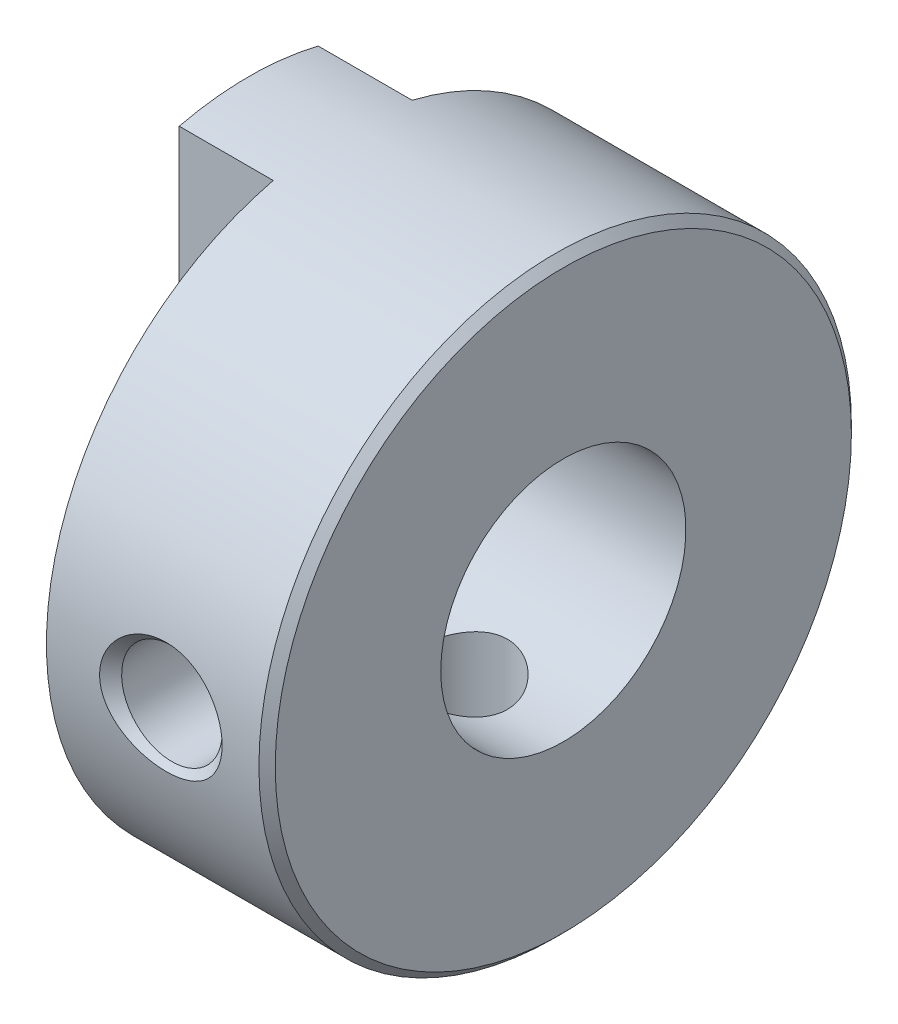
ISO-10303-21;
HEADER;
FILE_DESCRIPTION(('STEP AP214'),'2;1');
FILE_NAME('part.step','',(''),(''),'','','');
FILE_SCHEMA(('AUTOMOTIVE_DESIGN { 1 0 10303 214 1 1 1 1 }'));
ENDSEC;
DATA;
#1=APPLICATION_CONTEXT('core data for automotive mechanical design processes');
#2=APPLICATION_PROTOCOL_DEFINITION('international standard','automotive_design',2000,#1);
#3=PRODUCT_CONTEXT('',#1,'mechanical');
#4=PRODUCT('Part','Part','',(#3));
#5=PRODUCT_RELATED_PRODUCT_CATEGORY('part','',(#4));
#6=PRODUCT_DEFINITION_FORMATION('','',#4);
#7=PRODUCT_DEFINITION_CONTEXT('part definition',#1,'design');
#8=PRODUCT_DEFINITION('design','',#6,#7);
#9=PRODUCT_DEFINITION_SHAPE('','',#8);
#10=(LENGTH_UNIT() NAMED_UNIT(*) SI_UNIT(.MILLI.,.METRE.));
#11=(NAMED_UNIT(*) PLANE_ANGLE_UNIT() SI_UNIT($,.RADIAN.));
#12=(NAMED_UNIT(*) SI_UNIT($,.STERADIAN.) SOLID_ANGLE_UNIT());
#13=UNCERTAINTY_MEASURE_WITH_UNIT(LENGTH_MEASURE(1.E-05),#10,'distance_accuracy_value','');
#14=(GEOMETRIC_REPRESENTATION_CONTEXT(3) GLOBAL_UNCERTAINTY_ASSIGNED_CONTEXT((#13)) GLOBAL_UNIT_ASSIGNED_CONTEXT((#10,
#11,#12)) REPRESENTATION_CONTEXT('',''));
#15=CARTESIAN_POINT('',(0.,0.,0.));
#16=DIRECTION('',(0.,0.,1.));
#17=DIRECTION('',(1.,0.,0.));
#18=AXIS2_PLACEMENT_3D('',#15,#16,#17);
#19=CARTESIAN_POINT('',(5.4,0.,7.25162300000193));
#20=DIRECTION('',(0.,0.,1.));
#21=DIRECTION('',(1.,0.,0.));
#22=AXIS2_PLACEMENT_3D('',#19,#20,#21);
#23=CONICAL_SURFACE('',#22,1.50162299996737,0.785398163397448);
#24=CARTESIAN_POINT('',(5.4,0.,6.9795));
#25=DIRECTION('',(0.,0.,-1.));
#26=DIRECTION('',(0.,1.,0.));
#27=AXIS2_PLACEMENT_3D('',#24,#25,#26);
#28=CIRCLE('',#27,1.2295);
#29=CARTESIAN_POINT('',(5.4,1.2295,6.9795));
#30=VERTEX_POINT('',#29);
#31=EDGE_CURVE('E91',#30,#30,#28,.T.);
#32=ORIENTED_EDGE('',*,*,#31,.T.);
#33=EDGE_LOOP('',(#32));
#34=FACE_BOUND('',#33,.T.);
#35=CARTESIAN_POINT('',(6.89999999996705,0.,7.24999999999612));
#36=CARTESIAN_POINT('',(6.89999427514196,-0.0747291367992958,7.24999809172362));
#37=CARTESIAN_POINT('',(6.89321712195835,-0.14955836855151,7.24882959299291));
#38=CARTESIAN_POINT('',(6.86643720370093,-0.296824894614971,7.24429781560447));
#39=CARTESIAN_POINT('',(6.8464086780923,-0.36925724084981,7.2409302621728));
#40=CARTESIAN_POINT('',(6.79594187660678,-0.504603303096779,7.23271440670023));
#41=CARTESIAN_POINT('',(6.76631411268737,-0.567829063033793,7.22798384900006));
#42=CARTESIAN_POINT('',(6.69763255041028,-0.688772984074368,7.21746357544799));
#43=CARTESIAN_POINT('',(6.65858236062102,-0.746493241876686,7.21167426527847));
#44=CARTESIAN_POINT('',(6.56920706563386,-0.859327471027166,7.19913265249924));
#45=CARTESIAN_POINT('',(6.51827172630525,-0.913952871674558,7.19234100628031));
#46=CARTESIAN_POINT('',(6.40861244759573,-1.01475039384937,7.17881426122209));
#47=CARTESIAN_POINT('',(6.34988399057377,-1.06091757494001,7.17207919760995));
#48=CARTESIAN_POINT('',(6.22042778848734,-1.14798722867463,7.15868337478322));
#49=CARTESIAN_POINT('',(6.14909167557426,-1.18799583369443,7.1520882519355));
#50=CARTESIAN_POINT('',(6.00097820192068,-1.25642977973732,7.14038471197245));
#51=CARTESIAN_POINT('',(5.92420132917289,-1.28485615805388,7.13527616173277));
#52=CARTESIAN_POINT('',(5.77338159558935,-1.32793042323191,7.12737961387102));
#53=CARTESIAN_POINT('',(5.69960612631613,-1.34349354595094,7.12443949984581));
#54=CARTESIAN_POINT('',(5.55056066467196,-1.36427068473264,7.12048987418846));
#55=CARTESIAN_POINT('',(5.47529048882876,-1.36948342227566,7.11948060106181));
#56=CARTESIAN_POINT('',(5.3101149363233,-1.36947966923205,7.11948303738581));
#57=CARTESIAN_POINT('',(5.2202009213121,-1.36204566988025,7.12092442501107));
#58=CARTESIAN_POINT('',(5.04287949933191,-1.33242904087172,7.12652468160678));
#59=CARTESIAN_POINT('',(4.95547352984289,-1.31023812275574,7.13068507772917));
#60=CARTESIAN_POINT('',(4.78585696916784,-1.25153559814627,7.14122143164934));
#61=CARTESIAN_POINT('',(4.70364000461491,-1.21504197258608,7.14759460646487));
#62=CARTESIAN_POINT('',(4.54686849313921,-1.12839229867872,7.16178399013383));
#63=CARTESIAN_POINT('',(4.47231262833893,-1.07823860560043,7.16959995014743));
#64=CARTESIAN_POINT('',(4.33587265709776,-0.96718385014953,7.18540792779984));
#65=CARTESIAN_POINT('',(4.27364501675017,-0.906704095517743,7.1933850280879));
#66=CARTESIAN_POINT('',(4.16131989977757,-0.775233649090914,7.20873583764939));
#67=CARTESIAN_POINT('',(4.1112202053894,-0.704244882846388,7.21610965707757));
#68=CARTESIAN_POINT('',(4.02914184408745,-0.559933950232848,7.22867796612639));
#69=CARTESIAN_POINT('',(3.9960188586439,-0.487273801720987,7.2340011149047));
#70=CARTESIAN_POINT('',(3.94385602612471,-0.337061433975941,7.24254791022065));
#71=CARTESIAN_POINT('',(3.92477687513083,-0.259523532081718,7.24577741311253));
#72=CARTESIAN_POINT('',(3.90883028141451,-0.151016480242844,7.24848976641585));
#73=CARTESIAN_POINT('',(3.90552380614385,-0.120917686555794,7.24905444154122));
#74=CARTESIAN_POINT('',(3.90110741122121,-0.0605514175099595,7.24980996103482));
#75=CARTESIAN_POINT('',(3.89999768005297,-0.0302839279002416,7.25000077332507));
#76=CARTESIAN_POINT('',(3.90000572486061,0.0747291367994648,7.24999809172988));
#77=CARTESIAN_POINT('',(3.90678287804236,0.149558368551713,7.24882959299459));
#78=CARTESIAN_POINT('',(3.93356279629843,0.296824894615125,7.24429781560278));
#79=CARTESIAN_POINT('',(3.95359132190755,0.36925724084988,7.24093026217237));
#80=CARTESIAN_POINT('',(4.00405812339338,0.504603303096753,7.23271440670064));
#81=CARTESIAN_POINT('',(4.03368588731266,0.567829063033749,7.22798384900017));
#82=CARTESIAN_POINT('',(4.10236744958966,0.68877298407433,7.21746357544789));
#83=CARTESIAN_POINT('',(4.14141763937895,0.746493241876667,7.21167426527844));
#84=CARTESIAN_POINT('',(4.23079293436615,0.859327471027168,7.19913265249927));
#85=CARTESIAN_POINT('',(4.28172827369476,0.913952871674564,7.19234100628031));
#86=CARTESIAN_POINT('',(4.39138755240427,1.01475039384937,7.17881426122208));
#87=CARTESIAN_POINT('',(4.45011600942623,1.06091757494001,7.17207919760996));
#88=CARTESIAN_POINT('',(4.57957221151267,1.14798722867464,7.15868337478321));
#89=CARTESIAN_POINT('',(4.65090832442577,1.18799583369447,7.15208825193543));
#90=CARTESIAN_POINT('',(4.79902179807935,1.25642977973731,7.14038471197252));
#91=CARTESIAN_POINT('',(4.87579867082713,1.2848561580538,7.13527616173304));
#92=CARTESIAN_POINT('',(5.02661840441074,1.32793042323201,7.12737961387077));
#93=CARTESIAN_POINT('',(5.10039387368406,1.34349354595125,7.12443949984494));
#94=CARTESIAN_POINT('',(5.24943933532853,1.36427068473242,7.12048987418932));
#95=CARTESIAN_POINT('',(5.32470951117195,1.36948342227471,7.11948060106505));
#96=CARTESIAN_POINT('',(5.48988506367755,1.36947966923084,7.11948303738959));
#97=CARTESIAN_POINT('',(5.57979907868866,1.36204566987984,7.1209244250121));
#98=CARTESIAN_POINT('',(5.75712050066849,1.33242904087193,7.12652468160579));
#99=CARTESIAN_POINT('',(5.84452647015725,1.31023812275577,7.13068507772891));
#100=CARTESIAN_POINT('',(6.01414303083201,1.25153559814624,7.1412214316496));
#101=CARTESIAN_POINT('',(6.09635999538489,1.21504197258615,7.14759460646493));
#102=CARTESIAN_POINT('',(6.25313150686057,1.12839229867888,7.16178399013374));
#103=CARTESIAN_POINT('',(6.32768737166089,1.07823860560057,7.16959995014739));
#104=CARTESIAN_POINT('',(6.46412734290211,0.967183850149643,7.18540792779985));
#105=CARTESIAN_POINT('',(6.52635498324973,0.906704095517841,7.19338502808791));
#106=CARTESIAN_POINT('',(6.63868010022235,0.77523364909102,7.20873583764935));
#107=CARTESIAN_POINT('',(6.68877979461053,0.704244882846526,7.21610965707749));
#108=CARTESIAN_POINT('',(6.77085815591242,0.559933950233054,7.22867796612643));
#109=CARTESIAN_POINT('',(6.80398114135591,0.487273801721228,7.23400111490489));
#110=CARTESIAN_POINT('',(6.85614397387531,0.337061433976191,7.24254791022043));
#111=CARTESIAN_POINT('',(6.87522312486945,0.259523532081938,7.24577741311173));
#112=CARTESIAN_POINT('',(6.89116971858535,0.151016480243001,7.24848976641615));
#113=CARTESIAN_POINT('',(6.89447619385581,0.120917686555926,7.24905444154202));
#114=CARTESIAN_POINT('',(6.89889258877912,0.0605514175100764,7.24980996103401));
#115=CARTESIAN_POINT('',(6.90000231994822,0.0302839279003669,7.25000077332216));
#116=CARTESIAN_POINT('',(6.89999999996705,0.,7.24999999999612));
#117=B_SPLINE_CURVE_WITH_KNOTS('',3,(#35,#36,#37,#38,#39,#40,#41,#42,#43,#44,#45,#46,#47,#48,
#49,#50,#51,#52,#53,#54,#55,#56,#57,#58,#59,#60,#61,#62,#63,#64,#65,#66,#67,#68,#69,#70,#71,#72,
#73,#74,#75,#76,#77,#78,#79,#80,#81,#82,#83,#84,#85,#86,#87,#88,#89,#90,#91,#92,#93,#94,#95,#96,
#97,#98,#99,#100,#101,#102,#103,#104,#105,#106,#107,#108,#109,#110,#111,#112,#113,#114,#115,
#116),.UNSPECIFIED.,.T.,.F.,(4,2,2,2,2,2,2,2,2,2,2,2,2,2,2,2,2,2,2,2,2,2,2,2,2,2,2,2,2,2,2,2,2,
2,2,2,2,2,2,2,4),(0.,0.224055146580427,0.448547138937669,0.657602313094664,0.86657755073939,
1.09063144600252,1.31481579654558,1.55992930631005,1.80502085910826,2.03064066577801,
2.25628834014641,2.52567635840238,2.79521581068323,3.06441748745475,3.33357277782348,
3.59361636116129,3.85361235594049,4.09241268280953,4.33054212094667,4.421332515226,
4.51213069911203,4.73618584569246,4.96067783804948,5.16973301220641,5.3787082498512,
5.60276214511434,5.82694649565739,6.07206000542191,6.31715155822007,6.54277136489013,
6.76841903925903,7.03780705751456,7.30734650979468,7.57654818656603,7.84570347693481,
8.10574706027273,8.36574305505184,8.60454338192078,8.84267282005804,8.93346321433743,
9.02426139822348),.UNSPECIFIED.);
#118=CARTESIAN_POINT('',(6.89999999996705,0.,7.24999999999612));
#119=VERTEX_POINT('',#118);
#120=EDGE_CURVE('E102',#119,#119,#117,.T.);
#121=ORIENTED_EDGE('',*,*,#120,.F.);
#122=EDGE_LOOP('',(#121));
#123=FACE_BOUND('',#122,.T.);
#124=ADVANCED_FACE('F17',(#34,#123),#23,.F.);
#125=CARTESIAN_POINT('',(5.4,-7.25162300000193,0.));
#126=DIRECTION('',(0.,-1.,0.));
#127=DIRECTION('',(0.,0.,-1.));
#128=AXIS2_PLACEMENT_3D('',#125,#126,#127);
#129=CONICAL_SURFACE('',#128,1.50162299996737,0.785398163397448);
#130=CARTESIAN_POINT('',(5.4,-7.1194817115895,-1.3694817115595));
#131=CARTESIAN_POINT('',(5.31011493632329,-7.11948303738581,-1.36947966923205));
#132=CARTESIAN_POINT('',(5.2202009213121,-7.12092442501107,-1.36204566988025));
#133=CARTESIAN_POINT('',(5.04287949933191,-7.12652468160678,-1.33242904087172));
#134=CARTESIAN_POINT('',(4.95547352984289,-7.13068507772917,-1.31023812275574));
#135=CARTESIAN_POINT('',(4.78585696916784,-7.14122143164934,-1.25153559814627));
#136=CARTESIAN_POINT('',(4.70364000461492,-7.14759460646487,-1.21504197258609));
#137=CARTESIAN_POINT('',(4.54686849313922,-7.16178399013383,-1.12839229867872));
#138=CARTESIAN_POINT('',(4.47231262833893,-7.16959995014743,-1.07823860560043));
#139=CARTESIAN_POINT('',(4.33587265709775,-7.18540792779984,-0.967183850149525));
#140=CARTESIAN_POINT('',(4.27364501675016,-7.19338502808791,-0.906704095517728));
#141=CARTESIAN_POINT('',(4.16131989977756,-7.20873583764938,-0.775233649090896));
#142=CARTESIAN_POINT('',(4.11122020538939,-7.21610965707754,-0.704244882846378));
#143=CARTESIAN_POINT('',(4.02914184408747,-7.22867796612641,-0.559933950232861));
#144=CARTESIAN_POINT('',(3.99601885864395,-7.23400111490479,-0.487273801721013));
#145=CARTESIAN_POINT('',(3.94385602612468,-7.24254791022055,-0.337061433975969));
#146=CARTESIAN_POINT('',(3.92477687513069,-7.24577741311216,-0.259523532081734));
#147=CARTESIAN_POINT('',(3.90883028141457,-7.24848976641599,-0.15101648024286));
#148=CARTESIAN_POINT('',(3.905523806144,-7.24905444154159,-0.120917686555825));
#149=CARTESIAN_POINT('',(3.90110741122106,-7.24980996103444,-0.0605514175100361));
#150=CARTESIAN_POINT('',(3.89999768005243,-7.25000077332373,-0.030283927900348));
#151=CARTESIAN_POINT('',(3.90000572485944,-7.24999809172699,0.074729136799434));
#152=CARTESIAN_POINT('',(3.90678287804205,-7.24882959299381,0.149558368551789));
#153=CARTESIAN_POINT('',(3.93356279629881,-7.24429781560355,0.296824894615455));
#154=CARTESIAN_POINT('',(3.95359132190777,-7.24093026217254,0.369257240850359));
#155=CARTESIAN_POINT('',(4.00405812339357,-7.23271440670041,0.504603303097355));
#156=CARTESIAN_POINT('',(4.03368588731293,-7.22798384900008,0.567829063034338));
#157=CARTESIAN_POINT('',(4.10236744959002,-7.21746357544789,0.688772984074874));
#158=CARTESIAN_POINT('',(4.14141763937933,-7.2116742652784,0.746493241877181));
#159=CARTESIAN_POINT('',(4.23079293436656,-7.1991326524992,0.859327471027642));
#160=CARTESIAN_POINT('',(4.28172827369521,-7.19234100628025,0.913952871675024));
#161=CARTESIAN_POINT('',(4.39138755240478,-7.17881426122202,1.0147503938498));
#162=CARTESIAN_POINT('',(4.45011600942677,-7.17207919760989,1.06091757494042));
#163=CARTESIAN_POINT('',(4.57957221151325,-7.15868337478317,1.14798722867498));
#164=CARTESIAN_POINT('',(4.65090832442635,-7.15208825193545,1.18799583369476));
#165=CARTESIAN_POINT('',(4.79902179807998,-7.1403847119724,1.25642977973758));
#166=CARTESIAN_POINT('',(4.8757986708278,-7.13527616173273,1.28485615805411));
#167=CARTESIAN_POINT('',(5.02661840441125,-7.12737961387099,1.32793042323204));
#168=CARTESIAN_POINT('',(5.10039387368436,-7.1244394998458,1.34349354595102));
#169=CARTESIAN_POINT('',(5.24943933532829,-7.12048987418846,1.36427068473265));
#170=CARTESIAN_POINT('',(5.32470951117136,-7.11948060106181,1.36948342227566));
#171=CARTESIAN_POINT('',(5.4898850636767,-7.11948303738581,1.36947966923205));
#172=CARTESIAN_POINT('',(5.5797990786879,-7.12092442501107,1.36204566988025));
#173=CARTESIAN_POINT('',(5.75712050066809,-7.12652468160678,1.33242904087172));
#174=CARTESIAN_POINT('',(5.84452647015711,-7.13068507772917,1.31023812275574));
#175=CARTESIAN_POINT('',(6.01414303083216,-7.14122143164934,1.25153559814626));
#176=CARTESIAN_POINT('',(6.09635999538509,-7.14759460646487,1.21504197258608));
#177=CARTESIAN_POINT('',(6.25313150686079,-7.16178399013383,1.12839229867872));
#178=CARTESIAN_POINT('',(6.32768737166108,-7.16959995014743,1.07823860560043));
#179=CARTESIAN_POINT('',(6.46412734290224,-7.18540792779984,0.96718385014953));
#180=CARTESIAN_POINT('',(6.52635498324983,-7.1933850280879,0.906704095517742));
#181=CARTESIAN_POINT('',(6.63868010022243,-7.20873583764939,0.775233649090912));
#182=CARTESIAN_POINT('',(6.6887797946106,-7.21610965707757,0.704244882846386));
#183=CARTESIAN_POINT('',(6.77085815591255,-7.22867796612639,0.559933950232847));
#184=CARTESIAN_POINT('',(6.8039811413561,-7.2340011149047,0.487273801720986));
#185=CARTESIAN_POINT('',(6.85614397387529,-7.24254791022065,0.33706143397594));
#186=CARTESIAN_POINT('',(6.87522312486917,-7.24577741311253,0.259523532081717));
#187=CARTESIAN_POINT('',(6.89116971858549,-7.24848976641585,0.151016480242856));
#188=CARTESIAN_POINT('',(6.89447619385615,-7.24905444154122,0.120917686555817));
#189=CARTESIAN_POINT('',(6.89889258877879,-7.24980996103482,0.0605514175100075));
#190=CARTESIAN_POINT('',(6.90000231994703,-7.25000077332507,0.0302839279003017));
#191=CARTESIAN_POINT('',(6.8999942751394,-7.24999809172988,-0.074729136799514));
#192=CARTESIAN_POINT('',(6.89321712195763,-7.24882959299458,-0.149558368551885));
#193=CARTESIAN_POINT('',(6.86643720370148,-7.24429781560277,-0.296824894615529));
#194=CARTESIAN_POINT('',(6.8464086780923,-7.24093026217234,-0.369257240850394));
#195=CARTESIAN_POINT('',(6.79594187660636,-7.2327144067006,-0.504603303097346));
#196=CARTESIAN_POINT('',(6.76631411268706,-7.22798384900013,-0.567829063034321));
#197=CARTESIAN_POINT('',(6.69763255041001,-7.21746357544784,-0.688772984074859));
#198=CARTESIAN_POINT('',(6.65858236062068,-7.21167426527839,-0.746493241877176));
#199=CARTESIAN_POINT('',(6.56920706563343,-7.19913265249921,-0.85932747102765));
#200=CARTESIAN_POINT('',(6.51827172630478,-7.19234100628025,-0.913952871675035));
#201=CARTESIAN_POINT('',(6.40861244759521,-7.17881426122201,-1.01475039384981));
#202=CARTESIAN_POINT('',(6.34988399057323,-7.17207919760989,-1.06091757494042));
#203=CARTESIAN_POINT('',(6.22042778848675,-7.15868337478317,-1.14798722867498));
#204=CARTESIAN_POINT('',(6.14909167557365,-7.15208825193545,-1.18799583369476));
#205=CARTESIAN_POINT('',(6.00097820192002,-7.1403847119724,-1.25642977973758));
#206=CARTESIAN_POINT('',(5.9242013291722,-7.13527616173273,-1.28485615805411));
#207=CARTESIAN_POINT('',(5.77338159558875,-7.12737961387099,-1.32793042323205));
#208=CARTESIAN_POINT('',(5.69960612631564,-7.1244394998458,-1.34349354595102));
#209=CARTESIAN_POINT('',(5.55056066467171,-7.12048987418846,-1.36427068473266));
#210=CARTESIAN_POINT('',(5.47529048882864,-7.11948060106181,-1.36948342227566));
#211=CARTESIAN_POINT('',(5.4,-7.1194817115895,-1.3694817115595));
#212=B_SPLINE_CURVE_WITH_KNOTS('',3,(#130,#131,#132,#133,#134,#135,#136,#137,#138,#139,#140,
#141,#142,#143,#144,#145,#146,#147,#148,#149,#150,#151,#152,#153,#154,#155,#156,#157,#158,#159,
#160,#161,#162,#163,#164,#165,#166,#167,#168,#169,#170,#171,#172,#173,#174,#175,#176,#177,#178,
#179,#180,#181,#182,#183,#184,#185,#186,#187,#188,#189,#190,#191,#192,#193,#194,#195,#196,#197,
#198,#199,#200,#201,#202,#203,#204,#205,#206,#207,#208,#209,#210,#211),.UNSPECIFIED.,.T.,.F.,(4,
2,2,2,2,2,2,2,2,2,2,2,2,2,2,2,2,2,2,2,2,2,2,2,2,2,2,2,2,2,2,2,2,2,2,2,2,2,2,2,4),(0.,
0.26938801825597,0.538927470536824,0.80812914730833,1.07728443767707,1.33732802101491,
1.59732401579408,1.83612434266307,2.07425378080026,2.16504417507954,2.2558423589655,
2.47989750554629,2.70438949790377,2.91344467206071,3.12241990970546,3.34647380496865,
3.57065815551171,3.8157716652762,4.06086321807445,4.28648302474383,4.51213069911186,
4.78151871736783,5.05105816964869,5.32025984642021,5.58941513678893,5.84945872012674,
6.10945471490594,6.34825504177498,6.58638447991212,6.67717487419141,6.76797305807741,
6.9920282046582,7.21652019701558,7.42557537117249,7.63455060881727,7.85860450408047,
8.08278885462352,8.327902364388,8.57299391718626,8.79861372385565,9.02426139822367),.UNSPECIFIED.);
#213=CARTESIAN_POINT('',(5.4,-7.1194817115895,-1.3694817115595));
#214=VERTEX_POINT('',#213);
#215=EDGE_CURVE('E173',#214,#214,#212,.T.);
#216=ORIENTED_EDGE('',*,*,#215,.F.);
#217=EDGE_LOOP('',(#216));
#218=FACE_BOUND('',#217,.T.);
#219=CARTESIAN_POINT('',(5.4,-6.9795,0.));
#220=DIRECTION('',(0.,1.,0.));
#221=DIRECTION('',(0.,0.,1.));
#222=AXIS2_PLACEMENT_3D('',#219,#220,#221);
#223=CIRCLE('',#222,1.2295);
#224=CARTESIAN_POINT('',(5.4,-6.9795,1.2295));
#225=VERTEX_POINT('',#224);
#226=EDGE_CURVE('E109',#225,#225,#223,.T.);
#227=ORIENTED_EDGE('',*,*,#226,.T.);
#228=EDGE_LOOP('',(#227));
#229=FACE_BOUND('',#228,.T.);
#230=ADVANCED_FACE('F168',(#218,#229),#129,.F.);
#231=CARTESIAN_POINT('',(0.3,-7.25,-1.7));
#232=DIRECTION('',(0.,0.,1.));
#233=DIRECTION('',(1.,0.,0.));
#234=AXIS2_PLACEMENT_3D('',#231,#232,#233);
#235=PLANE('',#234);
#236=DIRECTION('',(0.,1.,0.));
#237=VECTOR('',#236,1.);
#238=CARTESIAN_POINT('',(2.6,0.,-1.7));
#239=LINE('',#238,#237);
#240=CARTESIAN_POINT('',(2.6,2.47184141886166,-1.7));
#241=VERTEX_POINT('',#240);
#242=CARTESIAN_POINT('',(2.6,7.04787201926936,-1.7));
#243=VERTEX_POINT('',#242);
#244=EDGE_CURVE('E112',#241,#243,#239,.T.);
#245=ORIENTED_EDGE('',*,*,#244,.F.);
#246=DIRECTION('',(-1.,0.,0.));
#247=VECTOR('',#246,1.);
#248=CARTESIAN_POINT('',(4.15,2.47184141886166,-1.7));
#249=LINE('',#248,#247);
#250=CARTESIAN_POINT('',(0.3,2.47184141886166,-1.7));
#251=VERTEX_POINT('',#250);
#252=EDGE_CURVE('E178',#241,#251,#249,.T.);
#253=ORIENTED_EDGE('',*,*,#252,.T.);
#254=DIRECTION('',(0.,1.,0.));
#255=VECTOR('',#254,1.);
#256=CARTESIAN_POINT('',(0.3,0.,-1.7));
#257=LINE('',#256,#255);
#258=CARTESIAN_POINT('',(0.3,7.04787201926936,-1.7));
#259=VERTEX_POINT('',#258);
#260=EDGE_CURVE('E92',#259,#251,#257,.F.);
#261=ORIENTED_EDGE('',*,*,#260,.F.);
#262=DIRECTION('',(-1.,0.,0.));
#263=VECTOR('',#262,1.);
#264=CARTESIAN_POINT('',(4.05,7.04787201926936,-1.7));
#265=LINE('',#264,#263);
#266=EDGE_CURVE('E108',#243,#259,#265,.T.);
#267=ORIENTED_EDGE('',*,*,#266,.F.);
#268=EDGE_LOOP('',(#245,#253,#261,#267));
#269=FACE_BOUND('',#268,.T.);
#270=ADVANCED_FACE('F166',(#269),#235,.F.);
#271=CARTESIAN_POINT('',(0.3,0.,-5.125));
#272=DIRECTION('',(-1.,0.,0.));
#273=DIRECTION('',(0.,0.,1.));
#274=AXIS2_PLACEMENT_3D('',#271,#272,#273);
#275=PLANE('',#274);
#276=ORIENTED_EDGE('',*,*,#260,.T.);
#277=CARTESIAN_POINT('',(0.3,0.,0.));
#278=DIRECTION('',(-1.,0.,0.));
#279=DIRECTION('',(0.,0.,1.));
#280=AXIS2_PLACEMENT_3D('',#277,#278,#279);
#281=CIRCLE('',#280,3.);
#282=CARTESIAN_POINT('',(0.3,2.47184141886166,1.7));
#283=VERTEX_POINT('',#282);
#284=EDGE_CURVE('E87',#251,#283,#281,.F.);
#285=ORIENTED_EDGE('',*,*,#284,.T.);
#286=DIRECTION('',(0.,1.,0.));
#287=VECTOR('',#286,1.);
#288=CARTESIAN_POINT('',(0.3,7.25,1.7));
#289=LINE('',#288,#287);
#290=CARTESIAN_POINT('',(0.3,7.04787201926936,1.7));
#291=VERTEX_POINT('',#290);
#292=EDGE_CURVE('E80',#283,#291,#289,.T.);
#293=ORIENTED_EDGE('',*,*,#292,.T.);
#294=CARTESIAN_POINT('',(0.3,0.,0.));
#295=DIRECTION('',(-1.,0.,0.));
#296=DIRECTION('',(0.,0.,1.));
#297=AXIS2_PLACEMENT_3D('',#294,#295,#296);
#298=CIRCLE('',#297,7.25);
#299=EDGE_CURVE('E21',#259,#291,#298,.F.);
#300=ORIENTED_EDGE('',*,*,#299,.F.);
#301=EDGE_LOOP('',(#276,#285,#293,#300));
#302=FACE_BOUND('',#301,.T.);
#303=ADVANCED_FACE('F83',(#302),#275,.T.);
#304=CARTESIAN_POINT('',(0.3,7.25,1.7));
#305=DIRECTION('',(0.,0.,-1.));
#306=DIRECTION('',(-1.,0.,0.));
#307=AXIS2_PLACEMENT_3D('',#304,#305,#306);
#308=PLANE('',#307);
#309=ORIENTED_EDGE('',*,*,#292,.F.);
#310=DIRECTION('',(-1.,0.,0.));
#311=VECTOR('',#310,1.);
#312=CARTESIAN_POINT('',(4.15,2.47184141886166,1.7));
#313=LINE('',#312,#311);
#314=CARTESIAN_POINT('',(2.6,2.47184141886166,1.7));
#315=VERTEX_POINT('',#314);
#316=EDGE_CURVE('E152',#283,#315,#313,.F.);
#317=ORIENTED_EDGE('',*,*,#316,.T.);
#318=DIRECTION('',(0.,1.,0.));
#319=VECTOR('',#318,1.);
#320=CARTESIAN_POINT('',(2.6,0.,1.7));
#321=LINE('',#320,#319);
#322=CARTESIAN_POINT('',(2.6,7.04787201926936,1.7));
#323=VERTEX_POINT('',#322);
#324=EDGE_CURVE('E99',#323,#315,#321,.F.);
#325=ORIENTED_EDGE('',*,*,#324,.F.);
#326=DIRECTION('',(-1.,0.,0.));
#327=VECTOR('',#326,1.);
#328=CARTESIAN_POINT('',(4.05,7.04787201926936,1.7));
#329=LINE('',#328,#327);
#330=EDGE_CURVE('E96',#291,#323,#329,.F.);
#331=ORIENTED_EDGE('',*,*,#330,.F.);
#332=EDGE_LOOP('',(#309,#317,#325,#331));
#333=FACE_BOUND('',#332,.T.);
#334=ADVANCED_FACE('F97',(#333),#308,.F.);
#335=CARTESIAN_POINT('',(5.4,0.,3.48975));
#336=DIRECTION('',(0.,0.,-1.));
#337=DIRECTION('',(0.,1.,0.));
#338=AXIS2_PLACEMENT_3D('',#335,#336,#337);
#339=CYLINDRICAL_SURFACE('',#338,1.2295);
#340=CARTESIAN_POINT('',(6.6295,0.,3.));
#341=CARTESIAN_POINT('',(6.62949750145217,-0.0660618005152105,2.9999979618055));
#342=CARTESIAN_POINT('',(6.6241527349594,-0.132150077379287,2.99779638894886));
#343=CARTESIAN_POINT('',(6.60299230887061,-0.262372350491959,2.98921889994536));
#344=CARTESIAN_POINT('',(6.58716876055329,-0.326504836287261,2.98283983890826));
#345=CARTESIAN_POINT('',(6.54572761454025,-0.450846774843428,2.96659076292204));
#346=CARTESIAN_POINT('',(6.52013554732716,-0.511065979047253,2.9567298529411));
#347=CARTESIAN_POINT('',(6.46000498662991,-0.626329402071269,2.93447815122244));
#348=CARTESIAN_POINT('',(6.42546541750386,-0.681372997610176,2.9220870553513));
#349=CARTESIAN_POINT('',(6.34665038134513,-0.787452568744791,2.89534856806647));
#350=CARTESIAN_POINT('',(6.30201064005429,-0.838201974781344,2.88093873285046));
#351=CARTESIAN_POINT('',(6.20502668422672,-0.931742819877235,2.85206182818473));
#352=CARTESIAN_POINT('',(6.15267820095977,-0.974529819829963,2.8375947313736));
#353=CARTESIAN_POINT('',(6.03874803269167,-1.0529376491371,2.80947350532111));
#354=CARTESIAN_POINT('',(5.97684522242372,-1.08811980435619,2.79589097301481));
#355=CARTESIAN_POINT('',(5.84739257259683,-1.14741547249582,2.77208729547346));
#356=CARTESIAN_POINT('',(5.77985041491867,-1.17154376122592,2.7618616682471));
#357=CARTESIAN_POINT('',(5.66005592500923,-1.20281493698979,2.74835183206861));
#358=CARTESIAN_POINT('',(5.6086568610317,-1.21279543792117,2.74393512935843));
#359=CARTESIAN_POINT('',(5.50484406590614,-1.2261383802188,2.73799900300401));
#360=CARTESIAN_POINT('',(5.45243053762656,-1.22950213124567,2.73647900601347));
#361=CARTESIAN_POINT('',(5.33420070686269,-1.22949732532862,2.73648411494169));
#362=CARTESIAN_POINT('',(5.26837462441866,-1.22419346815332,2.73888448474184));
#363=CARTESIAN_POINT('',(5.13869869303548,-1.20321041976784,2.74816484564123));
#364=CARTESIAN_POINT('',(5.07485058827478,-1.18752232987328,2.75504867872692));
#365=CARTESIAN_POINT('',(4.9511138614767,-1.146476385189,2.7723783929961));
#366=CARTESIAN_POINT('',(4.89121309975663,-1.12114997334989,2.78281267999024));
#367=CARTESIAN_POINT('',(4.77649916689426,-1.06164765587777,2.8060507562387));
#368=CARTESIAN_POINT('',(4.72168691316171,-1.02747015867093,2.81885497152768));
#369=CARTESIAN_POINT('',(4.61542170136879,-0.949052530015623,2.84624542616787));
#370=CARTESIAN_POINT('',(4.56431263743378,-0.90436685753954,2.86089067089818));
#371=CARTESIAN_POINT('',(4.47005681249843,-0.807132415515475,2.88982843527203));
#372=CARTESIAN_POINT('',(4.42691343346689,-0.754580323210644,2.90412080287487));
#373=CARTESIAN_POINT('',(4.34806151095181,-0.640397311378657,2.93146339857975));
#374=CARTESIAN_POINT('',(4.31274267965805,-0.578477217092073,2.94443594811279));
#375=CARTESIAN_POINT('',(4.25319865787915,-0.448977367468508,2.96693759170417));
#376=CARTESIAN_POINT('',(4.22895975509749,-0.38140473085932,2.97647093895147));
#377=CARTESIAN_POINT('',(4.19745014995214,-0.261338546725501,2.98903197158499));
#378=CARTESIAN_POINT('',(4.18736918038128,-0.209677116374272,2.99311975773889));
#379=CARTESIAN_POINT('',(4.17389357438762,-0.10534930954174,2.99860439741476));
#380=CARTESIAN_POINT('',(4.17049800745394,-0.0526830739451804,3.00000162542272));
#381=CARTESIAN_POINT('',(4.17050249854783,0.0660618005152098,2.9999979618055));
#382=CARTESIAN_POINT('',(4.1758472650406,0.132150077379287,2.99779638894886));
#383=CARTESIAN_POINT('',(4.19700769112939,0.262372350491958,2.98921889994536));
#384=CARTESIAN_POINT('',(4.21283123944671,0.32650483628726,2.98283983890826));
#385=CARTESIAN_POINT('',(4.25427238545975,0.450846774843428,2.96659076292204));
#386=CARTESIAN_POINT('',(4.27986445267284,0.511065979047253,2.9567298529411));
#387=CARTESIAN_POINT('',(4.33999501337009,0.626329402071269,2.93447815122244));
#388=CARTESIAN_POINT('',(4.37453458249614,0.681372997610175,2.9220870553513));
#389=CARTESIAN_POINT('',(4.45334961865487,0.78745256874479,2.89534856806647));
#390=CARTESIAN_POINT('',(4.49798935994571,0.838201974781343,2.88093873285046));
#391=CARTESIAN_POINT('',(4.59497331577328,0.931742819877234,2.85206182818473));
#392=CARTESIAN_POINT('',(4.64732179904023,0.974529819829962,2.8375947313736));
#393=CARTESIAN_POINT('',(4.76125196730833,1.0529376491371,2.80947350532111));
#394=CARTESIAN_POINT('',(4.82315477757628,1.08811980435619,2.79589097301481));
#395=CARTESIAN_POINT('',(4.95260742740317,1.14741547249582,2.77208729547346));
#396=CARTESIAN_POINT('',(5.02014958508133,1.17154376122592,2.7618616682471));
#397=CARTESIAN_POINT('',(5.13994407499077,1.20281493698979,2.74835183206862));
#398=CARTESIAN_POINT('',(5.1913431389683,1.21279543792117,2.74393512935843));
#399=CARTESIAN_POINT('',(5.29515593409387,1.2261383802188,2.73799900300401));
#400=CARTESIAN_POINT('',(5.34756946237344,1.22950213124567,2.73647900601347));
#401=CARTESIAN_POINT('',(5.46579929313731,1.22949732532861,2.73648411494169));
#402=CARTESIAN_POINT('',(5.53162537558134,1.22419346815332,2.73888448474184));
#403=CARTESIAN_POINT('',(5.66130130696452,1.20321041976784,2.74816484564123));
#404=CARTESIAN_POINT('',(5.72514941172522,1.18752232987328,2.75504867872692));
#405=CARTESIAN_POINT('',(5.8488861385233,1.146476385189,2.7723783929961));
#406=CARTESIAN_POINT('',(5.90878690024337,1.12114997334989,2.78281267999024));
#407=CARTESIAN_POINT('',(6.02350083310574,1.06164765587777,2.8060507562387));
#408=CARTESIAN_POINT('',(6.07831308683829,1.02747015867093,2.81885497152768));
#409=CARTESIAN_POINT('',(6.18457829863121,0.949052530015622,2.84624542616787));
#410=CARTESIAN_POINT('',(6.23568736256622,0.904366857539538,2.86089067089818));
#411=CARTESIAN_POINT('',(6.32994318750157,0.807132415515473,2.88982843527203));
#412=CARTESIAN_POINT('',(6.37308656653311,0.754580323210643,2.90412080287487));
#413=CARTESIAN_POINT('',(6.45193848904819,0.640397311378657,2.93146339857975));
#414=CARTESIAN_POINT('',(6.48725732034195,0.578477217092073,2.94443594811279));
#415=CARTESIAN_POINT('',(6.54680134212085,0.448977367468508,2.96693759170417));
#416=CARTESIAN_POINT('',(6.57104024490251,0.38140473085932,2.97647093895147));
#417=CARTESIAN_POINT('',(6.60254985004786,0.2613385467255,2.98903197158499));
#418=CARTESIAN_POINT('',(6.61263081961872,0.209677116374271,2.99311975773889));
#419=CARTESIAN_POINT('',(6.62610642561238,0.10534930954174,2.99860439741476));
#420=CARTESIAN_POINT('',(6.62950199254606,0.05268307394518,3.00000162542272));
#421=CARTESIAN_POINT('',(6.6295,0.,3.));
#422=B_SPLINE_CURVE_WITH_KNOTS('',3,(#340,#341,#342,#343,#344,#345,#346,#347,#348,#349,#350,
#351,#352,#353,#354,#355,#356,#357,#358,#359,#360,#361,#362,#363,#364,#365,#366,#367,#368,#369,
#370,#371,#372,#373,#374,#375,#376,#377,#378,#379,#380,#381,#382,#383,#384,#385,#386,#387,#388,
#389,#390,#391,#392,#393,#394,#395,#396,#397,#398,#399,#400,#401,#402,#403,#404,#405,#406,#407,
#408,#409,#410,#411,#412,#413,#414,#415,#416,#417,#418,#419,#420,#421),.UNSPECIFIED.,.T.,.F.,(4,
2,2,2,2,2,2,2,2,2,2,2,2,2,2,2,2,2,2,2,2,2,2,2,2,2,2,2,2,2,2,2,2,2,2,2,2,2,2,2,4),(0.,
0.197984842429405,0.396118903108233,0.593738638016211,0.791382141210624,0.997803692842602,
1.20433998365353,1.42071878051122,1.63680749172509,1.79396869596259,1.95109878997789,
2.14829396639295,2.34565834677533,2.54238431233066,2.73914567711105,2.94658845774994,
3.15411911028095,3.37039126304431,3.58639503224217,3.74430629236839,3.90219557198818,
4.10018041441759,4.29831447509642,4.4959342100044,4.69357771319881,4.89999926483079,
5.10653555564172,5.3229143524994,5.53900306371328,5.69616426795078,5.85329436196608,
6.05048953838114,6.24785391876352,6.44457988431884,6.64134124909923,6.84878402973813,
7.05631468226913,7.2725868350325,7.48859060423036,7.64650186435657,7.80439114397637),.UNSPECIFIED.);
#423=CARTESIAN_POINT('',(6.6295,0.,3.));
#424=VERTEX_POINT('',#423);
#425=EDGE_CURVE('E144',#424,#424,#422,.T.);
#426=ORIENTED_EDGE('',*,*,#425,.T.);
#427=EDGE_LOOP('',(#426));
#428=FACE_BOUND('',#427,.T.);
#429=ORIENTED_EDGE('',*,*,#31,.F.);
#430=EDGE_LOOP('',(#429));
#431=FACE_BOUND('',#430,.T.);
#432=ADVANCED_FACE('F154',(#428,#431),#339,.F.);
#433=CARTESIAN_POINT('',(2.6,0.,0.));
#434=DIRECTION('',(-1.,0.,0.));
#435=DIRECTION('',(0.,0.,1.));
#436=AXIS2_PLACEMENT_3D('',#433,#434,#435);
#437=PLANE('',#436);
#438=DIRECTION('',(0.,1.,0.));
#439=VECTOR('',#438,1.);
#440=CARTESIAN_POINT('',(2.6,7.25,1.7));
#441=LINE('',#440,#439);
#442=CARTESIAN_POINT('',(2.6,-2.47184141886166,1.7));
#443=VERTEX_POINT('',#442);
#444=CARTESIAN_POINT('',(2.6,-7.04787201926936,1.7));
#445=VERTEX_POINT('',#444);
#446=EDGE_CURVE('E227',#443,#445,#441,.F.);
#447=ORIENTED_EDGE('',*,*,#446,.T.);
#448=CARTESIAN_POINT('',(2.6,0.,0.));
#449=DIRECTION('',(-1.,0.,0.));
#450=DIRECTION('',(0.,0.,1.));
#451=AXIS2_PLACEMENT_3D('',#448,#449,#450);
#452=CIRCLE('',#451,7.25);
#453=EDGE_CURVE('E186',#323,#445,#452,.F.);
#454=ORIENTED_EDGE('',*,*,#453,.F.);
#455=ORIENTED_EDGE('',*,*,#324,.T.);
#456=CARTESIAN_POINT('',(2.6,0.,0.));
#457=DIRECTION('',(-1.,0.,0.));
#458=DIRECTION('',(0.,0.,1.));
#459=AXIS2_PLACEMENT_3D('',#456,#457,#458);
#460=CIRCLE('',#459,3.);
#461=EDGE_CURVE('E151',#315,#443,#460,.F.);
#462=ORIENTED_EDGE('',*,*,#461,.T.);
#463=EDGE_LOOP('',(#447,#454,#455,#462));
#464=FACE_BOUND('',#463,.T.);
#465=ADVANCED_FACE('F159',(#464),#437,.T.);
#466=CARTESIAN_POINT('',(0.3,7.25,1.7));
#467=DIRECTION('',(0.,0.,-1.));
#468=DIRECTION('',(-1.,0.,0.));
#469=AXIS2_PLACEMENT_3D('',#466,#467,#468);
#470=PLANE('',#469);
#471=ORIENTED_EDGE('',*,*,#446,.F.);
#472=DIRECTION('',(-1.,0.,0.));
#473=VECTOR('',#472,1.);
#474=CARTESIAN_POINT('',(4.15,-2.47184141886166,1.7));
#475=LINE('',#474,#473);
#476=CARTESIAN_POINT('',(0.3,-2.47184141886166,1.7));
#477=VERTEX_POINT('',#476);
#478=EDGE_CURVE('E228',#443,#477,#475,.T.);
#479=ORIENTED_EDGE('',*,*,#478,.T.);
#480=DIRECTION('',(0.,1.,0.));
#481=VECTOR('',#480,1.);
#482=CARTESIAN_POINT('',(0.3,0.,1.7));
#483=LINE('',#482,#481);
#484=CARTESIAN_POINT('',(0.3,-7.04787201926936,1.7));
#485=VERTEX_POINT('',#484);
#486=EDGE_CURVE('E224',#485,#477,#483,.T.);
#487=ORIENTED_EDGE('',*,*,#486,.F.);
#488=DIRECTION('',(-1.,0.,0.));
#489=VECTOR('',#488,1.);
#490=CARTESIAN_POINT('',(4.05,-7.04787201926936,1.7));
#491=LINE('',#490,#489);
#492=EDGE_CURVE('E185',#445,#485,#491,.T.);
#493=ORIENTED_EDGE('',*,*,#492,.F.);
#494=EDGE_LOOP('',(#471,#479,#487,#493));
#495=FACE_BOUND('',#494,.T.);
#496=ADVANCED_FACE('F240',(#495),#470,.F.);
#497=CARTESIAN_POINT('',(0.3,0.,-5.125));
#498=DIRECTION('',(-1.,0.,0.));
#499=DIRECTION('',(0.,0.,1.));
#500=AXIS2_PLACEMENT_3D('',#497,#498,#499);
#501=PLANE('',#500);
#502=DIRECTION('',(0.,1.,0.));
#503=VECTOR('',#502,1.);
#504=CARTESIAN_POINT('',(0.3,-7.25,-1.7));
#505=LINE('',#504,#503);
#506=CARTESIAN_POINT('',(0.3,-2.47184141886166,-1.7));
#507=VERTEX_POINT('',#506);
#508=CARTESIAN_POINT('',(0.3,-7.04787201926936,-1.7));
#509=VERTEX_POINT('',#508);
#510=EDGE_CURVE('E220',#507,#509,#505,.F.);
#511=ORIENTED_EDGE('',*,*,#510,.T.);
#512=CARTESIAN_POINT('',(0.3,0.,0.));
#513=DIRECTION('',(-1.,0.,0.));
#514=DIRECTION('',(0.,0.,1.));
#515=AXIS2_PLACEMENT_3D('',#512,#513,#514);
#516=CIRCLE('',#515,7.25);
#517=EDGE_CURVE('E182',#485,#509,#516,.F.);
#518=ORIENTED_EDGE('',*,*,#517,.F.);
#519=ORIENTED_EDGE('',*,*,#486,.T.);
#520=CARTESIAN_POINT('',(0.3,0.,0.));
#521=DIRECTION('',(-1.,0.,0.));
#522=DIRECTION('',(0.,0.,1.));
#523=AXIS2_PLACEMENT_3D('',#520,#521,#522);
#524=CIRCLE('',#523,3.);
#525=EDGE_CURVE('E222',#477,#507,#524,.F.);
#526=ORIENTED_EDGE('',*,*,#525,.T.);
#527=EDGE_LOOP('',(#511,#518,#519,#526));
#528=FACE_BOUND('',#527,.T.);
#529=ADVANCED_FACE('F244',(#528),#501,.T.);
#530=CARTESIAN_POINT('',(0.3,-7.25,-1.7));
#531=DIRECTION('',(0.,0.,1.));
#532=DIRECTION('',(1.,0.,0.));
#533=AXIS2_PLACEMENT_3D('',#530,#531,#532);
#534=PLANE('',#533);
#535=ORIENTED_EDGE('',*,*,#510,.F.);
#536=DIRECTION('',(-1.,0.,0.));
#537=VECTOR('',#536,1.);
#538=CARTESIAN_POINT('',(4.15,-2.47184141886166,-1.7));
#539=LINE('',#538,#537);
#540=CARTESIAN_POINT('',(2.6,-2.47184141886166,-1.7));
#541=VERTEX_POINT('',#540);
#542=EDGE_CURVE('E36',#507,#541,#539,.F.);
#543=ORIENTED_EDGE('',*,*,#542,.T.);
#544=DIRECTION('',(0.,1.,0.));
#545=VECTOR('',#544,1.);
#546=CARTESIAN_POINT('',(2.6,0.,-1.7));
#547=LINE('',#546,#545);
#548=CARTESIAN_POINT('',(2.6,-7.04787201926936,-1.7));
#549=VERTEX_POINT('',#548);
#550=EDGE_CURVE('E218',#549,#541,#547,.T.);
#551=ORIENTED_EDGE('',*,*,#550,.F.);
#552=DIRECTION('',(-1.,0.,0.));
#553=VECTOR('',#552,1.);
#554=CARTESIAN_POINT('',(4.05,-7.04787201926936,-1.7));
#555=LINE('',#554,#553);
#556=EDGE_CURVE('E181',#509,#549,#555,.F.);
#557=ORIENTED_EDGE('',*,*,#556,.F.);
#558=EDGE_LOOP('',(#535,#543,#551,#557));
#559=FACE_BOUND('',#558,.T.);
#560=ADVANCED_FACE('F246',(#559),#534,.F.);
#561=CARTESIAN_POINT('',(2.6,0.,0.));
#562=DIRECTION('',(-1.,0.,0.));
#563=DIRECTION('',(0.,0.,1.));
#564=AXIS2_PLACEMENT_3D('',#561,#562,#563);
#565=PLANE('',#564);
#566=ORIENTED_EDGE('',*,*,#244,.T.);
#567=CARTESIAN_POINT('',(2.6,0.,0.));
#568=DIRECTION('',(-1.,0.,0.));
#569=DIRECTION('',(0.,0.,1.));
#570=AXIS2_PLACEMENT_3D('',#567,#568,#569);
#571=CIRCLE('',#570,7.25);
#572=EDGE_CURVE('E179',#549,#243,#571,.F.);
#573=ORIENTED_EDGE('',*,*,#572,.F.);
#574=ORIENTED_EDGE('',*,*,#550,.T.);
#575=CARTESIAN_POINT('',(2.6,0.,0.));
#576=DIRECTION('',(-1.,0.,0.));
#577=DIRECTION('',(0.,0.,1.));
#578=AXIS2_PLACEMENT_3D('',#575,#576,#577);
#579=CIRCLE('',#578,3.);
#580=EDGE_CURVE('E128',#541,#241,#579,.F.);
#581=ORIENTED_EDGE('',*,*,#580,.T.);
#582=EDGE_LOOP('',(#566,#573,#574,#581));
#583=FACE_BOUND('',#582,.T.);
#584=ADVANCED_FACE('F250',(#583),#565,.T.);
#585=CARTESIAN_POINT('',(5.4,-3.48975,0.));
#586=DIRECTION('',(0.,1.,0.));
#587=DIRECTION('',(0.,0.,1.));
#588=AXIS2_PLACEMENT_3D('',#585,#586,#587);
#589=CYLINDRICAL_SURFACE('',#588,1.2295);
#590=ORIENTED_EDGE('',*,*,#226,.F.);
#591=EDGE_LOOP('',(#590));
#592=FACE_BOUND('',#591,.T.);
#593=CARTESIAN_POINT('',(5.4,-2.73648127163334,1.2295));
#594=CARTESIAN_POINT('',(5.46576104230234,-2.73648551052746,1.22949592457862));
#595=CARTESIAN_POINT('',(5.5315791497611,-2.73888331431976,1.22419646647581));
#596=CARTESIAN_POINT('',(5.66126572708964,-2.74816015559206,1.20322066647235));
#597=CARTESIAN_POINT('',(5.72513115150031,-2.75504585306019,1.18752890193684));
#598=CARTESIAN_POINT('',(5.84888836271425,-2.7723789718294,1.14647513439617));
#599=CARTESIAN_POINT('',(5.90879324826502,-2.78281387000525,1.12114709560174));
#600=CARTESIAN_POINT('',(6.02350726217314,-2.80605215520066,1.06164390552525));
#601=CARTESIAN_POINT('',(6.07831603915431,-2.81885570535685,1.02746814480755));
#602=CARTESIAN_POINT('',(6.18458155315088,-2.84624629366246,0.949049954625057));
#603=CARTESIAN_POINT('',(6.23569365422805,-2.86089246685064,0.904360978114482));
#604=CARTESIAN_POINT('',(6.32994847415595,-2.88983019412815,0.807126350322219));
#605=CARTESIAN_POINT('',(6.3730887887176,-2.90412164011045,0.754578337374684));
#606=CARTESIAN_POINT('',(6.45192206382287,-2.93145763353116,0.64041981275032));
#607=CARTESIAN_POINT('',(6.48722883411206,-2.94442519728397,0.578522507896366));
#608=CARTESIAN_POINT('',(6.5467805543915,-2.96692971946988,0.449039196750335));
#609=CARTESIAN_POINT('',(6.57103011676047,-2.97646810798948,0.381455576396193));
#610=CARTESIAN_POINT('',(6.60653476417315,-2.9906193777256,0.24614254568096));
#611=CARTESIAN_POINT('',(6.61838474778479,-2.99545686712794,0.178593196771101));
#612=CARTESIAN_POINT('',(6.63067340015775,-3.00047548855818,0.0423031394772582));
#613=CARTESIAN_POINT('',(6.63111652836733,-3.00065844025204,-0.0264370928197245));
#614=CARTESIAN_POINT('',(6.62089652791606,-2.99648142277568,-0.158843069751879));
#615=CARTESIAN_POINT('',(6.6108861894422,-2.99238846605602,-0.22256918118445));
#616=CARTESIAN_POINT('',(6.58115882672356,-2.98048340263195,-0.347344532312008));
#617=CARTESIAN_POINT('',(6.56144108950994,-2.97267102275248,-0.408393575028488));
#618=CARTESIAN_POINT('',(6.51262017875544,-2.95393623491822,-0.527195728478717));
#619=CARTESIAN_POINT('',(6.4833787666771,-2.94296831521126,-0.584884556810722));
#620=CARTESIAN_POINT('',(6.41647441240509,-2.91900254580051,-0.69468475679312));
#621=CARTESIAN_POINT('',(6.37880882545315,-2.90600405899022,-0.746794369242422));
#622=CARTESIAN_POINT('',(6.2931273451627,-2.87823806904617,-0.847744781274006));
#623=CARTESIAN_POINT('',(6.24457982928134,-2.8634103791952,-0.896118431501015));
#624=CARTESIAN_POINT('',(6.14000214711687,-2.83432768565368,-0.984248809764797));
#625=CARTESIAN_POINT('',(6.08396729430467,-2.82007304798139,-1.02400009961352));
#626=CARTESIAN_POINT('',(5.9637958142557,-2.79332420107787,-1.09490832811101));
#627=CARTESIAN_POINT('',(5.89945938216785,-2.78089970563252,-1.12575461671114));
#628=CARTESIAN_POINT('',(5.7659178696346,-2.76005658813804,-1.17594112692332));
#629=CARTESIAN_POINT('',(5.69672369902653,-2.75162929967464,-1.1953062640354));
#630=CARTESIAN_POINT('',(5.58902543481275,-2.74274909029157,-1.2154746474567));
#631=CARTESIAN_POINT('',(5.55145784557999,-2.74040972948793,-1.2207249184949));
#632=CARTESIAN_POINT('',(5.47593317751257,-2.73727460693573,-1.22773874728256));
#633=CARTESIAN_POINT('',(5.43797610409952,-2.73647882372985,-1.22950235350021));
#634=CARTESIAN_POINT('',(5.33423895769766,-2.73648551052746,-1.22949592457862));
#635=CARTESIAN_POINT('',(5.2684208502389,-2.73888331431976,-1.22419646647581));
#636=CARTESIAN_POINT('',(5.13873427291036,-2.74816015559206,-1.20322066647235));
#637=CARTESIAN_POINT('',(5.07486884849969,-2.75504585306019,-1.18752890193684));
#638=CARTESIAN_POINT('',(4.95111163728575,-2.7723789718294,-1.14647513439617));
#639=CARTESIAN_POINT('',(4.89120675173498,-2.78281387000525,-1.12114709560174));
#640=CARTESIAN_POINT('',(4.77649273782686,-2.80605215520066,-1.06164390552525));
#641=CARTESIAN_POINT('',(4.72168396084569,-2.81885570535685,-1.02746814480755));
#642=CARTESIAN_POINT('',(4.61541844684912,-2.84624629366246,-0.949049954625057));
#643=CARTESIAN_POINT('',(4.56430634577195,-2.86089246685064,-0.904360978114482));
#644=CARTESIAN_POINT('',(4.47005152584405,-2.88983019412815,-0.80712635032222));
#645=CARTESIAN_POINT('',(4.4269112112824,-2.90412164011045,-0.754578337374685));
#646=CARTESIAN_POINT('',(4.34807793617713,-2.93145763353116,-0.640419812750321));
#647=CARTESIAN_POINT('',(4.31277116588794,-2.94442519728397,-0.578522507896367));
#648=CARTESIAN_POINT('',(4.2532194456085,-2.96692971946988,-0.449039196750336));
#649=CARTESIAN_POINT('',(4.22896988323953,-2.97646810798948,-0.381455576396194));
#650=CARTESIAN_POINT('',(4.19346523582685,-2.9906193777256,-0.24614254568096));
#651=CARTESIAN_POINT('',(4.18161525221521,-2.99545686712794,-0.178593196771102));
#652=CARTESIAN_POINT('',(4.16932659984225,-3.00047548855818,-0.0423031394772591));
#653=CARTESIAN_POINT('',(4.16888347163267,-3.00065844025204,0.0264370928197237));
#654=CARTESIAN_POINT('',(4.17910347208394,-2.99648142277568,0.158843069751878));
#655=CARTESIAN_POINT('',(4.1891138105578,-2.99238846605602,0.222569181184449));
#656=CARTESIAN_POINT('',(4.21884117327644,-2.98048340263195,0.347344532312006));
#657=CARTESIAN_POINT('',(4.23855891049006,-2.97267102275248,0.408393575028487));
#658=CARTESIAN_POINT('',(4.28737982124456,-2.95393623491822,0.527195728478716));
#659=CARTESIAN_POINT('',(4.3166212333229,-2.94296831521126,0.584884556810721));
#660=CARTESIAN_POINT('',(4.38352558759491,-2.91900254580051,0.694684756793119));
#661=CARTESIAN_POINT('',(4.42119117454685,-2.90600405899022,0.746794369242421));
#662=CARTESIAN_POINT('',(4.5068726548373,-2.87823806904617,0.847744781274005));
#663=CARTESIAN_POINT('',(4.55542017071866,-2.8634103791952,0.896118431501014));
#664=CARTESIAN_POINT('',(4.65999785288313,-2.83432768565368,0.984248809764796));
#665=CARTESIAN_POINT('',(4.71603270569533,-2.82007304798139,1.02400009961352));
#666=CARTESIAN_POINT('',(4.83620418574431,-2.79332420107787,1.09490832811101));
#667=CARTESIAN_POINT('',(4.90054061783215,-2.78089970563252,1.12575461671114));
#668=CARTESIAN_POINT('',(5.0340821303654,-2.76005658813804,1.17594112692332));
#669=CARTESIAN_POINT('',(5.10327630097347,-2.75162929967464,1.1953062640354));
#670=CARTESIAN_POINT('',(5.21097456518725,-2.74274909029157,1.2154746474567));
#671=CARTESIAN_POINT('',(5.24854215442001,-2.74040972948793,1.2207249184949));
#672=CARTESIAN_POINT('',(5.32406682248743,-2.73727460693573,1.22773874728256));
#673=CARTESIAN_POINT('',(5.36202389590048,-2.73647882372985,1.22950235350021));
#674=CARTESIAN_POINT('',(5.4,-2.73648127163334,1.2295));
#675=B_SPLINE_CURVE_WITH_KNOTS('',3,(#593,#594,#595,#596,#597,#598,#599,#600,#601,#602,#603,
#604,#605,#606,#607,#608,#609,#610,#611,#612,#613,#614,#615,#616,#617,#618,#619,#620,#621,#622,
#623,#624,#625,#626,#627,#628,#629,#630,#631,#632,#633,#634,#635,#636,#637,#638,#639,#640,#641,
#642,#643,#644,#645,#646,#647,#648,#649,#650,#651,#652,#653,#654,#655,#656,#657,#658,#659,#660,
#661,#662,#663,#664,#665,#666,#667,#668,#669,#670,#671,#672,#673,#674),.UNSPECIFIED.,.T.,.F.,(4,
2,2,2,2,2,2,2,2,2,2,2,2,2,2,2,2,2,2,2,2,2,2,2,2,2,2,2,2,2,2,2,2,2,2,2,2,2,2,2,4),(0.,
0.197133176632273,0.39455956500783,0.591296451781682,0.788046893500665,0.995502376893688,
1.20302032705717,1.41920340915454,1.63529623044668,1.84046570911484,2.04555497666919,
2.23856135155675,2.43158190409035,2.62753934574218,2.82355839453995,3.03298070797716,
3.24253472404638,3.45869884309478,3.67439212606524,3.78823542667677,3.90207714473892,
4.0992103213712,4.29663670974675,4.4933735965206,4.69012403823959,4.89757952163261,
5.10509747179609,5.32128055389346,5.5373733751856,5.74254285385376,5.94763212140812,
6.14063849629567,6.33365904882927,6.5296164904811,6.72563553927888,6.93505785271608,
7.1446118687853,7.36077598783371,7.57646927080416,7.69031257141569,7.80415428947785),.UNSPECIFIED.);
#676=CARTESIAN_POINT('',(5.4,-2.73648127163334,1.2295));
#677=VERTEX_POINT('',#676);
#678=EDGE_CURVE('E121',#677,#677,#675,.T.);
#679=ORIENTED_EDGE('',*,*,#678,.T.);
#680=EDGE_LOOP('',(#679));
#681=FACE_BOUND('',#680,.T.);
#682=ADVANCED_FACE('F130',(#592,#681),#589,.F.);
#683=CARTESIAN_POINT('',(4.05,0.,0.));
#684=DIRECTION('',(-1.,0.,0.));
#685=DIRECTION('',(0.,0.,1.));
#686=AXIS2_PLACEMENT_3D('',#683,#684,#685);
#687=CYLINDRICAL_SURFACE('',#686,7.25);
#688=CARTESIAN_POINT('',(7.8,0.,0.));
#689=DIRECTION('',(-1.,0.,0.));
#690=DIRECTION('',(0.,0.,-1.));
#691=AXIS2_PLACEMENT_3D('',#688,#689,#690);
#692=CIRCLE('',#691,7.25);
#693=CARTESIAN_POINT('',(7.8,0.,-7.25));
#694=VERTEX_POINT('',#693);
#695=EDGE_CURVE('E120',#694,#694,#692,.F.);
#696=ORIENTED_EDGE('',*,*,#695,.F.);
#697=EDGE_LOOP('',(#696));
#698=FACE_BOUND('',#697,.T.);
#699=ORIENTED_EDGE('',*,*,#120,.T.);
#700=EDGE_LOOP('',(#699));
#701=FACE_BOUND('',#700,.T.);
#702=ORIENTED_EDGE('',*,*,#215,.T.);
#703=EDGE_LOOP('',(#702));
#704=FACE_BOUND('',#703,.T.);
#705=ORIENTED_EDGE('',*,*,#556,.T.);
#706=ORIENTED_EDGE('',*,*,#572,.T.);
#707=ORIENTED_EDGE('',*,*,#266,.T.);
#708=ORIENTED_EDGE('',*,*,#299,.T.);
#709=ORIENTED_EDGE('',*,*,#330,.T.);
#710=ORIENTED_EDGE('',*,*,#453,.T.);
#711=ORIENTED_EDGE('',*,*,#492,.T.);
#712=ORIENTED_EDGE('',*,*,#517,.T.);
#713=EDGE_LOOP('',(#705,#706,#707,#708,#709,#710,#711,#712));
#714=FACE_BOUND('',#713,.T.);
#715=ADVANCED_FACE('F105',(#698,#701,#704,#714),#687,.T.);
#716=CARTESIAN_POINT('',(4.15,0.,0.));
#717=DIRECTION('',(-1.,0.,0.));
#718=DIRECTION('',(0.,0.,1.));
#719=AXIS2_PLACEMENT_3D('',#716,#717,#718);
#720=CYLINDRICAL_SURFACE('',#719,3.);
#721=ORIENTED_EDGE('',*,*,#425,.F.);
#722=EDGE_LOOP('',(#721));
#723=FACE_BOUND('',#722,.T.);
#724=ORIENTED_EDGE('',*,*,#461,.F.);
#725=ORIENTED_EDGE('',*,*,#316,.F.);
#726=ORIENTED_EDGE('',*,*,#284,.F.);
#727=ORIENTED_EDGE('',*,*,#252,.F.);
#728=ORIENTED_EDGE('',*,*,#580,.F.);
#729=ORIENTED_EDGE('',*,*,#542,.F.);
#730=ORIENTED_EDGE('',*,*,#525,.F.);
#731=ORIENTED_EDGE('',*,*,#478,.F.);
#732=EDGE_LOOP('',(#724,#725,#726,#727,#728,#729,#730,#731));
#733=FACE_BOUND('',#732,.T.);
#734=ORIENTED_EDGE('',*,*,#678,.F.);
#735=EDGE_LOOP('',(#734));
#736=FACE_BOUND('',#735,.T.);
#737=CARTESIAN_POINT('',(8.,0.,0.));
#738=DIRECTION('',(-1.,0.,0.));
#739=DIRECTION('',(0.,0.,1.));
#740=AXIS2_PLACEMENT_3D('',#737,#738,#739);
#741=CIRCLE('',#740,3.);
#742=CARTESIAN_POINT('',(8.,0.,3.));
#743=VERTEX_POINT('',#742);
#744=EDGE_CURVE('E27',#743,#743,#741,.T.);
#745=ORIENTED_EDGE('',*,*,#744,.F.);
#746=EDGE_LOOP('',(#745));
#747=FACE_BOUND('',#746,.T.);
#748=ADVANCED_FACE('F134',(#723,#733,#736,#747),#720,.F.);
#749=CARTESIAN_POINT('',(7.8,0.,0.));
#750=DIRECTION('',(-1.,0.,0.));
#751=DIRECTION('',(0.,0.,1.));
#752=AXIS2_PLACEMENT_3D('',#749,#750,#751);
#753=CONICAL_SURFACE('',#752,7.25,0.785398163397448);
#754=CARTESIAN_POINT('',(8.,0.,0.));
#755=DIRECTION('',(-1.,0.,0.));
#756=DIRECTION('',(0.,0.,1.));
#757=AXIS2_PLACEMENT_3D('',#754,#755,#756);
#758=CIRCLE('',#757,7.05);
#759=CARTESIAN_POINT('',(8.,0.,7.05));
#760=VERTEX_POINT('',#759);
#761=EDGE_CURVE('E11',#760,#760,#758,.F.);
#762=ORIENTED_EDGE('',*,*,#761,.F.);
#763=EDGE_LOOP('',(#762));
#764=FACE_BOUND('',#763,.T.);
#765=ORIENTED_EDGE('',*,*,#695,.T.);
#766=EDGE_LOOP('',(#765));
#767=FACE_BOUND('',#766,.T.);
#768=ADVANCED_FACE('F138',(#764,#767),#753,.T.);
#769=CARTESIAN_POINT('',(8.,0.,-5.025));
#770=DIRECTION('',(1.,0.,0.));
#771=DIRECTION('',(0.,0.,-1.));
#772=AXIS2_PLACEMENT_3D('',#769,#770,#771);
#773=PLANE('',#772);
#774=ORIENTED_EDGE('',*,*,#761,.T.);
#775=EDGE_LOOP('',(#774));
#776=FACE_BOUND('',#775,.T.);
#777=ORIENTED_EDGE('',*,*,#744,.T.);
#778=EDGE_LOOP('',(#777));
#779=FACE_BOUND('',#778,.T.);
#780=ADVANCED_FACE('F199',(#776,#779),#773,.T.);
#781=CLOSED_SHELL('',(#124,#230,#270,#303,#334,#432,#465,#496,#529,#560,#584,#682,#715,#748,
#768,#780));
#782=MANIFOLD_SOLID_BREP('B1',#781);
#783=ADVANCED_BREP_SHAPE_REPRESENTATION('',(#18,#782),#14);
#784=SHAPE_DEFINITION_REPRESENTATION(#9,#783);
ENDSEC;
END-ISO-10303-21;
